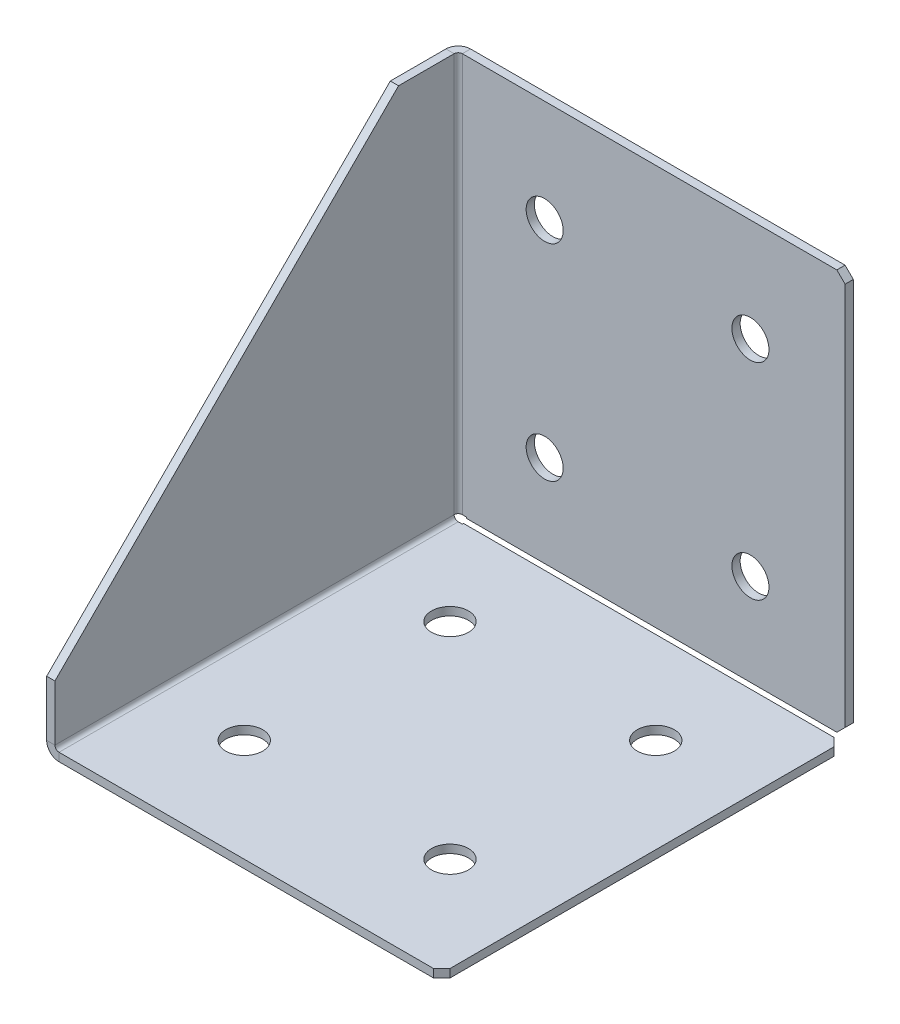
ISO-10303-21;
HEADER;
FILE_DESCRIPTION(('STEP AP214'),'2;1');
FILE_NAME('part.step','',(''),(''),'','','');
FILE_SCHEMA(('AUTOMOTIVE_DESIGN { 1 0 10303 214 1 1 1 1 }'));
ENDSEC;
DATA;
#1=APPLICATION_CONTEXT('core data for automotive mechanical design processes');
#2=APPLICATION_PROTOCOL_DEFINITION('international standard','automotive_design',2000,#1);
#3=PRODUCT_CONTEXT('',#1,'mechanical');
#4=PRODUCT('Part','Part','',(#3));
#5=PRODUCT_RELATED_PRODUCT_CATEGORY('part','',(#4));
#6=PRODUCT_DEFINITION_FORMATION('','',#4);
#7=PRODUCT_DEFINITION_CONTEXT('part definition',#1,'design');
#8=PRODUCT_DEFINITION('design','',#6,#7);
#9=PRODUCT_DEFINITION_SHAPE('','',#8);
#10=(LENGTH_UNIT() NAMED_UNIT(*) SI_UNIT(.MILLI.,.METRE.));
#11=(NAMED_UNIT(*) PLANE_ANGLE_UNIT() SI_UNIT($,.RADIAN.));
#12=(NAMED_UNIT(*) SI_UNIT($,.STERADIAN.) SOLID_ANGLE_UNIT());
#13=UNCERTAINTY_MEASURE_WITH_UNIT(LENGTH_MEASURE(1.E-05),#10,'distance_accuracy_value','');
#14=(GEOMETRIC_REPRESENTATION_CONTEXT(3) GLOBAL_UNCERTAINTY_ASSIGNED_CONTEXT((#13)) GLOBAL_UNIT_ASSIGNED_CONTEXT((#10,
#11,#12)) REPRESENTATION_CONTEXT('',''));
#15=CARTESIAN_POINT('',(0.,0.,0.));
#16=DIRECTION('',(0.,0.,1.));
#17=DIRECTION('',(1.,0.,0.));
#18=AXIS2_PLACEMENT_3D('',#15,#16,#17);
#19=CARTESIAN_POINT('',(-48.,2.,100.));
#20=DIRECTION('',(0.,-1.,0.));
#21=DIRECTION('',(0.,0.,-1.));
#22=AXIS2_PLACEMENT_3D('',#19,#20,#21);
#23=PLANE('',#22);
#24=CARTESIAN_POINT('',(25.,2.,75.));
#25=DIRECTION('',(0.,1.,0.));
#26=DIRECTION('',(0.,0.,1.));
#27=AXIS2_PLACEMENT_3D('',#24,#25,#26);
#28=CIRCLE('',#27,4.5);
#29=CARTESIAN_POINT('',(25.,2.,79.5));
#30=VERTEX_POINT('',#29);
#31=EDGE_CURVE('E541',#30,#30,#28,.T.);
#32=ORIENTED_EDGE('',*,*,#31,.F.);
#33=EDGE_LOOP('',(#32));
#34=FACE_BOUND('',#33,.T.);
#35=CARTESIAN_POINT('',(-25.,2.,75.));
#36=DIRECTION('',(0.,1.,0.));
#37=DIRECTION('',(0.,0.,1.));
#38=AXIS2_PLACEMENT_3D('',#35,#36,#37);
#39=CIRCLE('',#38,4.5);
#40=CARTESIAN_POINT('',(-25.,2.,79.5));
#41=VERTEX_POINT('',#40);
#42=EDGE_CURVE('E533',#41,#41,#39,.T.);
#43=ORIENTED_EDGE('',*,*,#42,.F.);
#44=EDGE_LOOP('',(#43));
#45=FACE_BOUND('',#44,.T.);
#46=DIRECTION('',(1.,0.,0.));
#47=VECTOR('',#46,1.);
#48=CARTESIAN_POINT('',(-48.,2.,100.));
#49=LINE('',#48,#47);
#50=CARTESIAN_POINT('',(-45.,2.,100.));
#51=VERTEX_POINT('',#50);
#52=CARTESIAN_POINT('',(46.,2.,100.));
#53=VERTEX_POINT('',#52);
#54=EDGE_CURVE('E351',#51,#53,#49,.T.);
#55=ORIENTED_EDGE('',*,*,#54,.T.);
#56=DIRECTION('',(-0.707106781186552,0.,0.707106781186543));
#57=VECTOR('',#56,1.);
#58=CARTESIAN_POINT('',(48.,2.,98.));
#59=LINE('',#58,#57);
#60=CARTESIAN_POINT('',(48.,2.,98.));
#61=VERTEX_POINT('',#60);
#62=EDGE_CURVE('E432',#53,#61,#59,.F.);
#63=ORIENTED_EDGE('',*,*,#62,.T.);
#64=DIRECTION('',(0.,0.,-1.));
#65=VECTOR('',#64,1.);
#66=CARTESIAN_POINT('',(48.,2.,100.));
#67=LINE('',#66,#65);
#68=CARTESIAN_POINT('',(48.,2.,4.70710678118656));
#69=VERTEX_POINT('',#68);
#70=EDGE_CURVE('E359',#61,#69,#67,.T.);
#71=ORIENTED_EDGE('',*,*,#70,.T.);
#72=DIRECTION('',(-0.707106781186548,0.,-0.707106781186548));
#73=VECTOR('',#72,1.);
#74=CARTESIAN_POINT('',(46.,2.,2.70710678118655));
#75=LINE('',#74,#73);
#76=CARTESIAN_POINT('',(46.,2.,2.70710678118655));
#77=VERTEX_POINT('',#76);
#78=EDGE_CURVE('E429',#69,#77,#75,.T.);
#79=ORIENTED_EDGE('',*,*,#78,.T.);
#80=DIRECTION('',(1.,0.,0.));
#81=VECTOR('',#80,1.);
#82=CARTESIAN_POINT('',(-48.,2.,2.70710678118655));
#83=LINE('',#82,#81);
#84=CARTESIAN_POINT('',(-43.989699,2.,2.70710678118655));
#85=VERTEX_POINT('',#84);
#86=EDGE_CURVE('E329',#85,#77,#83,.T.);
#87=ORIENTED_EDGE('',*,*,#86,.F.);
#88=DIRECTION('',(0.,0.,-1.));
#89=VECTOR('',#88,1.);
#90=CARTESIAN_POINT('',(-43.989699,2.,100.));
#91=LINE('',#90,#89);
#92=CARTESIAN_POINT('',(-43.989699,2.,2.99999999999998));
#93=VERTEX_POINT('',#92);
#94=EDGE_CURVE('E328',#93,#85,#91,.T.);
#95=ORIENTED_EDGE('',*,*,#94,.F.);
#96=DIRECTION('',(1.,0.,0.));
#97=VECTOR('',#96,1.);
#98=CARTESIAN_POINT('',(-48.,2.,2.99999999999998));
#99=LINE('',#98,#97);
#100=CARTESIAN_POINT('',(-45.,2.,2.99999999999998));
#101=VERTEX_POINT('',#100);
#102=EDGE_CURVE('E324',#93,#101,#99,.F.);
#103=ORIENTED_EDGE('',*,*,#102,.T.);
#104=DIRECTION('',(0.,0.,-1.));
#105=VECTOR('',#104,1.);
#106=CARTESIAN_POINT('',(-45.,2.,100.));
#107=LINE('',#106,#105);
#108=EDGE_CURVE('E310',#51,#101,#107,.T.);
#109=ORIENTED_EDGE('',*,*,#108,.F.);
#110=EDGE_LOOP('',(#55,#63,#71,#79,#87,#95,#103,#109));
#111=FACE_BOUND('',#110,.T.);
#112=CARTESIAN_POINT('',(25.,2.,25.));
#113=DIRECTION('',(0.,1.,0.));
#114=DIRECTION('',(0.,0.,1.));
#115=AXIS2_PLACEMENT_3D('',#112,#113,#114);
#116=CIRCLE('',#115,4.5);
#117=CARTESIAN_POINT('',(25.,2.,29.5));
#118=VERTEX_POINT('',#117);
#119=EDGE_CURVE('E525',#118,#118,#116,.T.);
#120=ORIENTED_EDGE('',*,*,#119,.F.);
#121=EDGE_LOOP('',(#120));
#122=FACE_BOUND('',#121,.T.);
#123=CARTESIAN_POINT('',(-25.,2.,25.));
#124=DIRECTION('',(0.,1.,0.));
#125=DIRECTION('',(0.,0.,1.));
#126=AXIS2_PLACEMENT_3D('',#123,#124,#125);
#127=CIRCLE('',#126,4.5);
#128=CARTESIAN_POINT('',(-25.,2.,29.5));
#129=VERTEX_POINT('',#128);
#130=EDGE_CURVE('E549',#129,#129,#127,.T.);
#131=ORIENTED_EDGE('',*,*,#130,.F.);
#132=EDGE_LOOP('',(#131));
#133=FACE_BOUND('',#132,.T.);
#134=ADVANCED_FACE('F53',(#34,#45,#111,#122,#133),#23,.F.);
#135=CARTESIAN_POINT('',(-48.,0.,2.));
#136=DIRECTION('',(0.,0.,-1.));
#137=DIRECTION('',(-1.,0.,0.));
#138=AXIS2_PLACEMENT_3D('',#135,#136,#137);
#139=PLANE('',#138);
#140=CARTESIAN_POINT('',(25.,75.,2.));
#141=DIRECTION('',(0.,0.,1.));
#142=DIRECTION('',(1.,0.,0.));
#143=AXIS2_PLACEMENT_3D('',#140,#141,#142);
#144=CIRCLE('',#143,4.5);
#145=CARTESIAN_POINT('',(29.5,75.,2.));
#146=VERTEX_POINT('',#145);
#147=EDGE_CURVE('E509',#146,#146,#144,.T.);
#148=ORIENTED_EDGE('',*,*,#147,.F.);
#149=EDGE_LOOP('',(#148));
#150=FACE_BOUND('',#149,.T.);
#151=CARTESIAN_POINT('',(-25.,75.,2.));
#152=DIRECTION('',(0.,0.,1.));
#153=DIRECTION('',(1.,0.,0.));
#154=AXIS2_PLACEMENT_3D('',#151,#152,#153);
#155=CIRCLE('',#154,4.5);
#156=CARTESIAN_POINT('',(-20.5,75.,2.));
#157=VERTEX_POINT('',#156);
#158=EDGE_CURVE('E501',#157,#157,#155,.T.);
#159=ORIENTED_EDGE('',*,*,#158,.F.);
#160=EDGE_LOOP('',(#159));
#161=FACE_BOUND('',#160,.T.);
#162=CARTESIAN_POINT('',(25.,25.,2.));
#163=DIRECTION('',(0.,0.,1.));
#164=DIRECTION('',(1.,0.,0.));
#165=AXIS2_PLACEMENT_3D('',#162,#163,#164);
#166=CIRCLE('',#165,4.5);
#167=CARTESIAN_POINT('',(29.5,25.,2.));
#168=VERTEX_POINT('',#167);
#169=EDGE_CURVE('E493',#168,#168,#166,.T.);
#170=ORIENTED_EDGE('',*,*,#169,.F.);
#171=EDGE_LOOP('',(#170));
#172=FACE_BOUND('',#171,.T.);
#173=DIRECTION('',(-1.,0.,0.));
#174=VECTOR('',#173,1.);
#175=CARTESIAN_POINT('',(-48.,2.70710678118655,2.));
#176=LINE('',#175,#174);
#177=CARTESIAN_POINT('',(46.,2.70710678118655,2.));
#178=VERTEX_POINT('',#177);
#179=CARTESIAN_POINT('',(-43.989699,2.70710678118655,2.));
#180=VERTEX_POINT('',#179);
#181=EDGE_CURVE('E325',#178,#180,#176,.T.);
#182=ORIENTED_EDGE('',*,*,#181,.F.);
#183=DIRECTION('',(0.70710678118655,0.707106781186545,0.));
#184=VECTOR('',#183,1.);
#185=CARTESIAN_POINT('',(48.,4.70710678118658,2.));
#186=LINE('',#185,#184);
#187=CARTESIAN_POINT('',(48.,4.70710678118658,2.));
#188=VERTEX_POINT('',#187);
#189=EDGE_CURVE('E452',#178,#188,#186,.T.);
#190=ORIENTED_EDGE('',*,*,#189,.T.);
#191=DIRECTION('',(0.,1.,0.));
#192=VECTOR('',#191,1.);
#193=CARTESIAN_POINT('',(48.,0.,2.));
#194=LINE('',#193,#192);
#195=CARTESIAN_POINT('',(48.,98.,2.));
#196=VERTEX_POINT('',#195);
#197=EDGE_CURVE('E330',#188,#196,#194,.T.);
#198=ORIENTED_EDGE('',*,*,#197,.T.);
#199=DIRECTION('',(-0.707106781186548,0.707106781186548,0.));
#200=VECTOR('',#199,1.);
#201=CARTESIAN_POINT('',(46.,100.,2.));
#202=LINE('',#201,#200);
#203=CARTESIAN_POINT('',(46.,100.,2.));
#204=VERTEX_POINT('',#203);
#205=EDGE_CURVE('E70',#196,#204,#202,.T.);
#206=ORIENTED_EDGE('',*,*,#205,.T.);
#207=DIRECTION('',(-1.,0.,0.));
#208=VECTOR('',#207,1.);
#209=CARTESIAN_POINT('',(-48.,100.,2.));
#210=LINE('',#209,#208);
#211=CARTESIAN_POINT('',(-45.,100.,2.));
#212=VERTEX_POINT('',#211);
#213=EDGE_CURVE('E333',#212,#204,#210,.F.);
#214=ORIENTED_EDGE('',*,*,#213,.F.);
#215=DIRECTION('',(0.,1.,0.));
#216=VECTOR('',#215,1.);
#217=CARTESIAN_POINT('',(-45.,0.,2.));
#218=LINE('',#217,#216);
#219=CARTESIAN_POINT('',(-45.,2.99999999999998,2.));
#220=VERTEX_POINT('',#219);
#221=EDGE_CURVE('E301',#220,#212,#218,.T.);
#222=ORIENTED_EDGE('',*,*,#221,.F.);
#223=DIRECTION('',(-1.,0.,0.));
#224=VECTOR('',#223,1.);
#225=CARTESIAN_POINT('',(-48.,2.99999999999998,2.));
#226=LINE('',#225,#224);
#227=CARTESIAN_POINT('',(-43.989699,2.99999999999998,2.));
#228=VERTEX_POINT('',#227);
#229=EDGE_CURVE('E306',#220,#228,#226,.F.);
#230=ORIENTED_EDGE('',*,*,#229,.T.);
#231=DIRECTION('',(0.,1.,0.));
#232=VECTOR('',#231,1.);
#233=CARTESIAN_POINT('',(-43.989699,0.,2.));
#234=LINE('',#233,#232);
#235=EDGE_CURVE('E320',#180,#228,#234,.T.);
#236=ORIENTED_EDGE('',*,*,#235,.F.);
#237=EDGE_LOOP('',(#182,#190,#198,#206,#214,#222,#230,#236));
#238=FACE_BOUND('',#237,.T.);
#239=CARTESIAN_POINT('',(-25.,25.,2.));
#240=DIRECTION('',(0.,0.,1.));
#241=DIRECTION('',(1.,0.,0.));
#242=AXIS2_PLACEMENT_3D('',#239,#240,#241);
#243=CIRCLE('',#242,4.5);
#244=CARTESIAN_POINT('',(-20.5,25.,2.));
#245=VERTEX_POINT('',#244);
#246=EDGE_CURVE('E517',#245,#245,#243,.T.);
#247=ORIENTED_EDGE('',*,*,#246,.F.);
#248=EDGE_LOOP('',(#247));
#249=FACE_BOUND('',#248,.T.);
#250=ADVANCED_FACE('F560',(#150,#161,#172,#238,#249),#139,.F.);
#251=CARTESIAN_POINT('',(-45.,3.,2.99999999999998));
#252=DIRECTION('',(0.,0.,-1.));
#253=DIRECTION('',(-1.,0.,0.));
#254=AXIS2_PLACEMENT_3D('',#251,#252,#253);
#255=PLANE('',#254);
#256=DIRECTION('',(-1.,0.,0.));
#257=VECTOR('',#256,1.);
#258=CARTESIAN_POINT('',(-48.,2.99999999999998,2.99999999999998));
#259=LINE('',#258,#257);
#260=CARTESIAN_POINT('',(-46.,2.99999999999998,2.99999999999999));
#261=VERTEX_POINT('',#260);
#262=CARTESIAN_POINT('',(-48.,2.99999999999998,2.99999999999998));
#263=VERTEX_POINT('',#262);
#264=EDGE_CURVE('E408',#261,#263,#259,.T.);
#265=ORIENTED_EDGE('',*,*,#264,.F.);
#266=CARTESIAN_POINT('',(-45.,3.,2.99999999999998));
#267=DIRECTION('',(0.,0.,1.));
#268=DIRECTION('',(1.,0.,0.));
#269=AXIS2_PLACEMENT_3D('',#266,#267,#268);
#270=CIRCLE('',#269,1.);
#271=EDGE_CURVE('E355',#261,#101,#270,.T.);
#272=ORIENTED_EDGE('',*,*,#271,.T.);
#273=DIRECTION('',(0.,-1.,0.));
#274=VECTOR('',#273,1.);
#275=CARTESIAN_POINT('',(-45.,0.,2.99999999999998));
#276=LINE('',#275,#274);
#277=CARTESIAN_POINT('',(-45.,0.,2.99999999999998));
#278=VERTEX_POINT('',#277);
#279=EDGE_CURVE('E405',#101,#278,#276,.T.);
#280=ORIENTED_EDGE('',*,*,#279,.T.);
#281=CARTESIAN_POINT('',(-45.,3.,2.99999999999998));
#282=DIRECTION('',(0.,0.,1.));
#283=DIRECTION('',(1.,0.,0.));
#284=AXIS2_PLACEMENT_3D('',#281,#282,#283);
#285=CIRCLE('',#284,3.);
#286=EDGE_CURVE('E293',#263,#278,#285,.T.);
#287=ORIENTED_EDGE('',*,*,#286,.F.);
#288=EDGE_LOOP('',(#265,#272,#280,#287));
#289=FACE_BOUND('',#288,.T.);
#290=ADVANCED_FACE('F566',(#289),#255,.T.);
#291=CARTESIAN_POINT('',(-48.,0.,2.99999999999998));
#292=DIRECTION('',(0.,0.,1.));
#293=DIRECTION('',(-1.,0.,0.));
#294=AXIS2_PLACEMENT_3D('',#291,#292,#293);
#295=PLANE('',#294);
#296=ORIENTED_EDGE('',*,*,#279,.F.);
#297=ORIENTED_EDGE('',*,*,#102,.F.);
#298=DIRECTION('',(0.,-1.,0.));
#299=VECTOR('',#298,1.);
#300=CARTESIAN_POINT('',(-43.989699,0.,2.99999999999998));
#301=LINE('',#300,#299);
#302=CARTESIAN_POINT('',(-43.989699,0.,2.99999999999998));
#303=VERTEX_POINT('',#302);
#304=EDGE_CURVE('E402',#93,#303,#301,.T.);
#305=ORIENTED_EDGE('',*,*,#304,.T.);
#306=DIRECTION('',(-1.,0.,0.));
#307=VECTOR('',#306,1.);
#308=CARTESIAN_POINT('',(-48.,0.,2.99999999999998));
#309=LINE('',#308,#307);
#310=EDGE_CURVE('E257',#303,#278,#309,.T.);
#311=ORIENTED_EDGE('',*,*,#310,.T.);
#312=EDGE_LOOP('',(#296,#297,#305,#311));
#313=FACE_BOUND('',#312,.T.);
#314=ADVANCED_FACE('F629',(#313),#295,.F.);
#315=CARTESIAN_POINT('',(-43.989699,0.,100.));
#316=DIRECTION('',(-1.,0.,0.));
#317=DIRECTION('',(0.,0.,-1.));
#318=AXIS2_PLACEMENT_3D('',#315,#316,#317);
#319=PLANE('',#318);
#320=ORIENTED_EDGE('',*,*,#304,.F.);
#321=ORIENTED_EDGE('',*,*,#94,.T.);
#322=DIRECTION('',(0.,-1.,0.));
#323=VECTOR('',#322,1.);
#324=CARTESIAN_POINT('',(-43.989699,0.,2.70710678118655));
#325=LINE('',#324,#323);
#326=CARTESIAN_POINT('',(-43.989699,0.,2.70710678118655));
#327=VERTEX_POINT('',#326);
#328=EDGE_CURVE('E399',#85,#327,#325,.T.);
#329=ORIENTED_EDGE('',*,*,#328,.T.);
#330=DIRECTION('',(0.,0.,-1.));
#331=VECTOR('',#330,1.);
#332=CARTESIAN_POINT('',(-43.989699,0.,100.));
#333=LINE('',#332,#331);
#334=EDGE_CURVE('E253',#303,#327,#333,.T.);
#335=ORIENTED_EDGE('',*,*,#334,.F.);
#336=EDGE_LOOP('',(#320,#321,#329,#335));
#337=FACE_BOUND('',#336,.T.);
#338=ADVANCED_FACE('F472',(#337),#319,.T.);
#339=CARTESIAN_POINT('',(-48.,0.,2.70710678118655));
#340=DIRECTION('',(0.,0.,-1.));
#341=DIRECTION('',(1.,0.,0.));
#342=AXIS2_PLACEMENT_3D('',#339,#340,#341);
#343=PLANE('',#342);
#344=ORIENTED_EDGE('',*,*,#86,.T.);
#345=DIRECTION('',(0.,-1.,0.));
#346=VECTOR('',#345,1.);
#347=CARTESIAN_POINT('',(46.,0.,2.70710678118655));
#348=LINE('',#347,#346);
#349=CARTESIAN_POINT('',(46.,0.,2.70710678118655));
#350=VERTEX_POINT('',#349);
#351=EDGE_CURVE('E63',#77,#350,#348,.T.);
#352=ORIENTED_EDGE('',*,*,#351,.T.);
#353=DIRECTION('',(1.,0.,0.));
#354=VECTOR('',#353,1.);
#355=CARTESIAN_POINT('',(-48.,0.,2.70710678118655));
#356=LINE('',#355,#354);
#357=EDGE_CURVE('E246',#327,#350,#356,.T.);
#358=ORIENTED_EDGE('',*,*,#357,.F.);
#359=ORIENTED_EDGE('',*,*,#328,.F.);
#360=EDGE_LOOP('',(#344,#352,#358,#359));
#361=FACE_BOUND('',#360,.T.);
#362=ADVANCED_FACE('F461',(#361),#343,.T.);
#363=CARTESIAN_POINT('',(48.,0.,100.));
#364=DIRECTION('',(-1.,0.,0.));
#365=DIRECTION('',(0.,0.,-1.));
#366=AXIS2_PLACEMENT_3D('',#363,#364,#365);
#367=PLANE('',#366);
#368=ORIENTED_EDGE('',*,*,#70,.F.);
#369=DIRECTION('',(0.,1.,0.));
#370=VECTOR('',#369,1.);
#371=CARTESIAN_POINT('',(48.,0.,98.));
#372=LINE('',#371,#370);
#373=CARTESIAN_POINT('',(48.,0.,98.));
#374=VERTEX_POINT('',#373);
#375=EDGE_CURVE('E416',#61,#374,#372,.F.);
#376=ORIENTED_EDGE('',*,*,#375,.T.);
#377=DIRECTION('',(0.,0.,-1.));
#378=VECTOR('',#377,1.);
#379=CARTESIAN_POINT('',(48.,0.,100.));
#380=LINE('',#379,#378);
#381=CARTESIAN_POINT('',(48.,0.,4.70710678118656));
#382=VERTEX_POINT('',#381);
#383=EDGE_CURVE('E286',#374,#382,#380,.T.);
#384=ORIENTED_EDGE('',*,*,#383,.T.);
#385=DIRECTION('',(0.,-1.,0.));
#386=VECTOR('',#385,1.);
#387=CARTESIAN_POINT('',(48.,0.,4.70710678118656));
#388=LINE('',#387,#386);
#389=EDGE_CURVE('E411',#382,#69,#388,.F.);
#390=ORIENTED_EDGE('',*,*,#389,.T.);
#391=EDGE_LOOP('',(#368,#376,#384,#390));
#392=FACE_BOUND('',#391,.T.);
#393=ADVANCED_FACE('F481',(#392),#367,.F.);
#394=CARTESIAN_POINT('',(-48.,0.,100.));
#395=DIRECTION('',(0.,0.,-1.));
#396=DIRECTION('',(1.,0.,0.));
#397=AXIS2_PLACEMENT_3D('',#394,#395,#396);
#398=PLANE('',#397);
#399=DIRECTION('',(1.,0.,0.));
#400=VECTOR('',#399,1.);
#401=CARTESIAN_POINT('',(-48.,0.,100.));
#402=LINE('',#401,#400);
#403=CARTESIAN_POINT('',(-45.,0.,100.));
#404=VERTEX_POINT('',#403);
#405=CARTESIAN_POINT('',(46.,0.,100.));
#406=VERTEX_POINT('',#405);
#407=EDGE_CURVE('E226',#404,#406,#402,.T.);
#408=ORIENTED_EDGE('',*,*,#407,.T.);
#409=DIRECTION('',(0.,-1.,0.));
#410=VECTOR('',#409,1.);
#411=CARTESIAN_POINT('',(46.,0.,100.));
#412=LINE('',#411,#410);
#413=EDGE_CURVE('E426',#406,#53,#412,.F.);
#414=ORIENTED_EDGE('',*,*,#413,.T.);
#415=ORIENTED_EDGE('',*,*,#54,.F.);
#416=DIRECTION('',(0.,-1.,0.));
#417=VECTOR('',#416,1.);
#418=CARTESIAN_POINT('',(-45.,0.,100.));
#419=LINE('',#418,#417);
#420=EDGE_CURVE('E396',#51,#404,#419,.T.);
#421=ORIENTED_EDGE('',*,*,#420,.T.);
#422=EDGE_LOOP('',(#408,#414,#415,#421));
#423=FACE_BOUND('',#422,.T.);
#424=ADVANCED_FACE('F618',(#423),#398,.F.);
#425=CARTESIAN_POINT('',(-45.,3.,100.));
#426=DIRECTION('',(0.,0.,-1.));
#427=DIRECTION('',(-1.,0.,0.));
#428=AXIS2_PLACEMENT_3D('',#425,#426,#427);
#429=PLANE('',#428);
#430=ORIENTED_EDGE('',*,*,#420,.F.);
#431=CARTESIAN_POINT('',(-45.,3.,100.));
#432=DIRECTION('',(0.,0.,1.));
#433=DIRECTION('',(1.,0.,0.));
#434=AXIS2_PLACEMENT_3D('',#431,#432,#433);
#435=CIRCLE('',#434,1.);
#436=CARTESIAN_POINT('',(-46.,3.,100.));
#437=VERTEX_POINT('',#436);
#438=EDGE_CURVE('E342',#51,#437,#435,.F.);
#439=ORIENTED_EDGE('',*,*,#438,.T.);
#440=DIRECTION('',(-1.,0.,0.));
#441=VECTOR('',#440,1.);
#442=CARTESIAN_POINT('',(-48.,3.,100.));
#443=LINE('',#442,#441);
#444=CARTESIAN_POINT('',(-48.,3.,100.));
#445=VERTEX_POINT('',#444);
#446=EDGE_CURVE('E213',#437,#445,#443,.T.);
#447=ORIENTED_EDGE('',*,*,#446,.T.);
#448=CARTESIAN_POINT('',(-45.,3.,100.));
#449=DIRECTION('',(0.,0.,1.));
#450=DIRECTION('',(1.,0.,0.));
#451=AXIS2_PLACEMENT_3D('',#448,#449,#450);
#452=CIRCLE('',#451,3.);
#453=EDGE_CURVE('E282',#404,#445,#452,.F.);
#454=ORIENTED_EDGE('',*,*,#453,.F.);
#455=EDGE_LOOP('',(#430,#439,#447,#454));
#456=FACE_BOUND('',#455,.T.);
#457=ADVANCED_FACE('F615',(#456),#429,.F.);
#458=CARTESIAN_POINT('',(-48.,16.5,100.));
#459=DIRECTION('',(0.,0.,1.));
#460=DIRECTION('',(0.,-1.,0.));
#461=AXIS2_PLACEMENT_3D('',#458,#459,#460);
#462=PLANE('',#461);
#463=ORIENTED_EDGE('',*,*,#446,.F.);
#464=DIRECTION('',(0.,1.,0.));
#465=VECTOR('',#464,1.);
#466=CARTESIAN_POINT('',(-46.,0.,100.));
#467=LINE('',#466,#465);
#468=CARTESIAN_POINT('',(-46.,16.5,100.));
#469=VERTEX_POINT('',#468);
#470=EDGE_CURVE('E207',#469,#437,#467,.F.);
#471=ORIENTED_EDGE('',*,*,#470,.F.);
#472=DIRECTION('',(-1.,0.,0.));
#473=VECTOR('',#472,1.);
#474=CARTESIAN_POINT('',(-48.,16.5,100.));
#475=LINE('',#474,#473);
#476=CARTESIAN_POINT('',(-48.,16.5,100.));
#477=VERTEX_POINT('',#476);
#478=EDGE_CURVE('E201',#469,#477,#475,.T.);
#479=ORIENTED_EDGE('',*,*,#478,.T.);
#480=DIRECTION('',(0.,-1.,0.));
#481=VECTOR('',#480,1.);
#482=CARTESIAN_POINT('',(-48.,16.5,100.));
#483=LINE('',#482,#481);
#484=EDGE_CURVE('E204',#477,#445,#483,.T.);
#485=ORIENTED_EDGE('',*,*,#484,.T.);
#486=EDGE_LOOP('',(#463,#471,#479,#485));
#487=FACE_BOUND('',#486,.T.);
#488=ADVANCED_FACE('F203',(#487),#462,.T.);
#489=CARTESIAN_POINT('',(-48.,100.,16.5));
#490=DIRECTION('',(0.,0.707106781186548,0.707106781186548));
#491=DIRECTION('',(0.,-0.707106781186547,0.707106781186547));
#492=AXIS2_PLACEMENT_3D('',#489,#490,#491);
#493=PLANE('',#492);
#494=ORIENTED_EDGE('',*,*,#478,.F.);
#495=DIRECTION('',(0.,-0.707106781186547,0.707106781186547));
#496=VECTOR('',#495,1.);
#497=CARTESIAN_POINT('',(-46.,100.,16.5));
#498=LINE('',#497,#496);
#499=CARTESIAN_POINT('',(-46.,100.,16.5));
#500=VERTEX_POINT('',#499);
#501=EDGE_CURVE('E346',#500,#469,#498,.T.);
#502=ORIENTED_EDGE('',*,*,#501,.F.);
#503=DIRECTION('',(-1.,0.,0.));
#504=VECTOR('',#503,1.);
#505=CARTESIAN_POINT('',(-48.,100.,16.5));
#506=LINE('',#505,#504);
#507=CARTESIAN_POINT('',(-48.,100.,16.5));
#508=VERTEX_POINT('',#507);
#509=EDGE_CURVE('E214',#500,#508,#506,.T.);
#510=ORIENTED_EDGE('',*,*,#509,.T.);
#511=DIRECTION('',(0.,-0.707106781186547,0.707106781186547));
#512=VECTOR('',#511,1.);
#513=CARTESIAN_POINT('',(-48.,100.,16.5));
#514=LINE('',#513,#512);
#515=EDGE_CURVE('E221',#508,#477,#514,.T.);
#516=ORIENTED_EDGE('',*,*,#515,.T.);
#517=EDGE_LOOP('',(#494,#502,#510,#516));
#518=FACE_BOUND('',#517,.T.);
#519=ADVANCED_FACE('F228',(#518),#493,.T.);
#520=CARTESIAN_POINT('',(-48.,100.,0.));
#521=DIRECTION('',(0.,1.,0.));
#522=DIRECTION('',(0.,0.,1.));
#523=AXIS2_PLACEMENT_3D('',#520,#521,#522);
#524=PLANE('',#523);
#525=ORIENTED_EDGE('',*,*,#509,.F.);
#526=DIRECTION('',(0.,0.,-1.));
#527=VECTOR('',#526,1.);
#528=CARTESIAN_POINT('',(-46.,100.,0.));
#529=LINE('',#528,#527);
#530=CARTESIAN_POINT('',(-46.,100.,3.));
#531=VERTEX_POINT('',#530);
#532=EDGE_CURVE('E336',#531,#500,#529,.F.);
#533=ORIENTED_EDGE('',*,*,#532,.F.);
#534=DIRECTION('',(-1.,0.,0.));
#535=VECTOR('',#534,1.);
#536=CARTESIAN_POINT('',(-48.,100.,3.));
#537=LINE('',#536,#535);
#538=CARTESIAN_POINT('',(-48.,100.,3.));
#539=VERTEX_POINT('',#538);
#540=EDGE_CURVE('E389',#531,#539,#537,.T.);
#541=ORIENTED_EDGE('',*,*,#540,.T.);
#542=DIRECTION('',(0.,0.,1.));
#543=VECTOR('',#542,1.);
#544=CARTESIAN_POINT('',(-48.,100.,0.));
#545=LINE('',#544,#543);
#546=EDGE_CURVE('E230',#539,#508,#545,.T.);
#547=ORIENTED_EDGE('',*,*,#546,.T.);
#548=EDGE_LOOP('',(#525,#533,#541,#547));
#549=FACE_BOUND('',#548,.T.);
#550=ADVANCED_FACE('F606',(#549),#524,.T.);
#551=CARTESIAN_POINT('',(-45.,100.,3.));
#552=DIRECTION('',(0.,1.,0.));
#553=DIRECTION('',(0.,0.,1.));
#554=AXIS2_PLACEMENT_3D('',#551,#552,#553);
#555=PLANE('',#554);
#556=ORIENTED_EDGE('',*,*,#540,.F.);
#557=CARTESIAN_POINT('',(-45.,100.,3.));
#558=DIRECTION('',(0.,-1.,0.));
#559=DIRECTION('',(0.,0.,-1.));
#560=AXIS2_PLACEMENT_3D('',#557,#558,#559);
#561=CIRCLE('',#560,1.);
#562=EDGE_CURVE('E337',#531,#212,#561,.T.);
#563=ORIENTED_EDGE('',*,*,#562,.T.);
#564=DIRECTION('',(0.,0.,-1.));
#565=VECTOR('',#564,1.);
#566=CARTESIAN_POINT('',(-45.,100.,0.));
#567=LINE('',#566,#565);
#568=CARTESIAN_POINT('',(-45.,100.,0.));
#569=VERTEX_POINT('',#568);
#570=EDGE_CURVE('E386',#212,#569,#567,.T.);
#571=ORIENTED_EDGE('',*,*,#570,.T.);
#572=CARTESIAN_POINT('',(-45.,100.,3.));
#573=DIRECTION('',(0.,-1.,0.));
#574=DIRECTION('',(0.,0.,-1.));
#575=AXIS2_PLACEMENT_3D('',#572,#573,#574);
#576=CIRCLE('',#575,3.);
#577=EDGE_CURVE('E277',#539,#569,#576,.T.);
#578=ORIENTED_EDGE('',*,*,#577,.F.);
#579=EDGE_LOOP('',(#556,#563,#571,#578));
#580=FACE_BOUND('',#579,.T.);
#581=ADVANCED_FACE('F602',(#580),#555,.T.);
#582=CARTESIAN_POINT('',(-48.,100.,0.));
#583=DIRECTION('',(0.,1.,0.));
#584=DIRECTION('',(1.,0.,0.));
#585=AXIS2_PLACEMENT_3D('',#582,#583,#584);
#586=PLANE('',#585);
#587=ORIENTED_EDGE('',*,*,#213,.T.);
#588=DIRECTION('',(0.,0.,-1.));
#589=VECTOR('',#588,1.);
#590=CARTESIAN_POINT('',(46.,100.,0.));
#591=LINE('',#590,#589);
#592=CARTESIAN_POINT('',(46.,100.,0.));
#593=VERTEX_POINT('',#592);
#594=EDGE_CURVE('E11',#204,#593,#591,.T.);
#595=ORIENTED_EDGE('',*,*,#594,.T.);
#596=DIRECTION('',(1.,0.,0.));
#597=VECTOR('',#596,1.);
#598=CARTESIAN_POINT('',(-48.,100.,0.));
#599=LINE('',#598,#597);
#600=EDGE_CURVE('E235',#569,#593,#599,.T.);
#601=ORIENTED_EDGE('',*,*,#600,.F.);
#602=ORIENTED_EDGE('',*,*,#570,.F.);
#603=EDGE_LOOP('',(#587,#595,#601,#602));
#604=FACE_BOUND('',#603,.T.);
#605=ADVANCED_FACE('F598',(#604),#586,.T.);
#606=CARTESIAN_POINT('',(48.,0.,0.));
#607=DIRECTION('',(-1.,0.,0.));
#608=DIRECTION('',(0.,1.,0.));
#609=AXIS2_PLACEMENT_3D('',#606,#607,#608);
#610=PLANE('',#609);
#611=ORIENTED_EDGE('',*,*,#197,.F.);
#612=DIRECTION('',(0.,0.,1.));
#613=VECTOR('',#612,1.);
#614=CARTESIAN_POINT('',(48.,4.70710678118658,0.));
#615=LINE('',#614,#613);
#616=CARTESIAN_POINT('',(48.,4.70710678118658,0.));
#617=VERTEX_POINT('',#616);
#618=EDGE_CURVE('E438',#188,#617,#615,.F.);
#619=ORIENTED_EDGE('',*,*,#618,.T.);
#620=DIRECTION('',(0.,1.,0.));
#621=VECTOR('',#620,1.);
#622=CARTESIAN_POINT('',(48.,0.,0.));
#623=LINE('',#622,#621);
#624=CARTESIAN_POINT('',(48.,98.,0.));
#625=VERTEX_POINT('',#624);
#626=EDGE_CURVE('E242',#617,#625,#623,.T.);
#627=ORIENTED_EDGE('',*,*,#626,.T.);
#628=DIRECTION('',(0.,0.,-1.));
#629=VECTOR('',#628,1.);
#630=CARTESIAN_POINT('',(48.,98.,0.));
#631=LINE('',#630,#629);
#632=EDGE_CURVE('E435',#625,#196,#631,.F.);
#633=ORIENTED_EDGE('',*,*,#632,.T.);
#634=EDGE_LOOP('',(#611,#619,#627,#633));
#635=FACE_BOUND('',#634,.T.);
#636=ADVANCED_FACE('F595',(#635),#610,.F.);
#637=CARTESIAN_POINT('',(-48.,2.70710678118655,0.));
#638=DIRECTION('',(0.,-1.,0.));
#639=DIRECTION('',(-1.,0.,0.));
#640=AXIS2_PLACEMENT_3D('',#637,#638,#639);
#641=PLANE('',#640);
#642=DIRECTION('',(-1.,0.,0.));
#643=VECTOR('',#642,1.);
#644=CARTESIAN_POINT('',(-48.,2.70710678118655,0.));
#645=LINE('',#644,#643);
#646=CARTESIAN_POINT('',(46.,2.70710678118655,0.));
#647=VERTEX_POINT('',#646);
#648=CARTESIAN_POINT('',(-43.989699,2.70710678118655,0.));
#649=VERTEX_POINT('',#648);
#650=EDGE_CURVE('E250',#647,#649,#645,.T.);
#651=ORIENTED_EDGE('',*,*,#650,.F.);
#652=DIRECTION('',(0.,0.,1.));
#653=VECTOR('',#652,1.);
#654=CARTESIAN_POINT('',(46.,2.70710678118655,0.));
#655=LINE('',#654,#653);
#656=EDGE_CURVE('E78',#647,#178,#655,.T.);
#657=ORIENTED_EDGE('',*,*,#656,.T.);
#658=ORIENTED_EDGE('',*,*,#181,.T.);
#659=DIRECTION('',(0.,0.,-1.));
#660=VECTOR('',#659,1.);
#661=CARTESIAN_POINT('',(-43.989699,2.70710678118655,0.));
#662=LINE('',#661,#660);
#663=EDGE_CURVE('E382',#180,#649,#662,.T.);
#664=ORIENTED_EDGE('',*,*,#663,.T.);
#665=EDGE_LOOP('',(#651,#657,#658,#664));
#666=FACE_BOUND('',#665,.T.);
#667=ADVANCED_FACE('F591',(#666),#641,.T.);
#668=CARTESIAN_POINT('',(-43.989699,0.,0.));
#669=DIRECTION('',(-1.,0.,0.));
#670=DIRECTION('',(0.,1.,0.));
#671=AXIS2_PLACEMENT_3D('',#668,#669,#670);
#672=PLANE('',#671);
#673=ORIENTED_EDGE('',*,*,#663,.F.);
#674=ORIENTED_EDGE('',*,*,#235,.T.);
#675=DIRECTION('',(0.,0.,-1.));
#676=VECTOR('',#675,1.);
#677=CARTESIAN_POINT('',(-43.989699,2.99999999999998,0.));
#678=LINE('',#677,#676);
#679=CARTESIAN_POINT('',(-43.989699,2.99999999999998,0.));
#680=VERTEX_POINT('',#679);
#681=EDGE_CURVE('E379',#228,#680,#678,.T.);
#682=ORIENTED_EDGE('',*,*,#681,.T.);
#683=DIRECTION('',(0.,1.,0.));
#684=VECTOR('',#683,1.);
#685=CARTESIAN_POINT('',(-43.989699,0.,0.));
#686=LINE('',#685,#684);
#687=EDGE_CURVE('E261',#649,#680,#686,.T.);
#688=ORIENTED_EDGE('',*,*,#687,.F.);
#689=EDGE_LOOP('',(#673,#674,#682,#688));
#690=FACE_BOUND('',#689,.T.);
#691=ADVANCED_FACE('F587',(#690),#672,.T.);
#692=CARTESIAN_POINT('',(-48.,2.99999999999998,0.));
#693=DIRECTION('',(0.,1.,0.));
#694=DIRECTION('',(1.,0.,0.));
#695=AXIS2_PLACEMENT_3D('',#692,#693,#694);
#696=PLANE('',#695);
#697=ORIENTED_EDGE('',*,*,#681,.F.);
#698=ORIENTED_EDGE('',*,*,#229,.F.);
#699=DIRECTION('',(0.,0.,-1.));
#700=VECTOR('',#699,1.);
#701=CARTESIAN_POINT('',(-45.,2.99999999999998,0.));
#702=LINE('',#701,#700);
#703=CARTESIAN_POINT('',(-45.,2.99999999999998,0.));
#704=VERTEX_POINT('',#703);
#705=EDGE_CURVE('E292',#220,#704,#702,.T.);
#706=ORIENTED_EDGE('',*,*,#705,.T.);
#707=DIRECTION('',(1.,0.,0.));
#708=VECTOR('',#707,1.);
#709=CARTESIAN_POINT('',(-48.,2.99999999999998,0.));
#710=LINE('',#709,#708);
#711=EDGE_CURVE('E265',#704,#680,#710,.T.);
#712=ORIENTED_EDGE('',*,*,#711,.T.);
#713=EDGE_LOOP('',(#697,#698,#706,#712));
#714=FACE_BOUND('',#713,.T.);
#715=ADVANCED_FACE('F583',(#714),#696,.F.);
#716=CARTESIAN_POINT('',(-45.,2.99999999999998,3.));
#717=DIRECTION('',(0.,-1.,0.));
#718=DIRECTION('',(0.,0.,-1.));
#719=AXIS2_PLACEMENT_3D('',#716,#717,#718);
#720=PLANE('',#719);
#721=CARTESIAN_POINT('',(-45.,2.99999999999998,3.));
#722=DIRECTION('',(0.,-1.,0.));
#723=DIRECTION('',(0.,0.,-1.));
#724=AXIS2_PLACEMENT_3D('',#721,#722,#723);
#725=CIRCLE('',#724,1.);
#726=EDGE_CURVE('E341',#220,#261,#725,.F.);
#727=ORIENTED_EDGE('',*,*,#726,.T.);
#728=ORIENTED_EDGE('',*,*,#264,.T.);
#729=CARTESIAN_POINT('',(-45.,2.99999999999998,3.));
#730=DIRECTION('',(0.,1.,0.));
#731=DIRECTION('',(0.,0.,1.));
#732=AXIS2_PLACEMENT_3D('',#729,#730,#731);
#733=CIRCLE('',#732,3.);
#734=EDGE_CURVE('E281',#704,#263,#733,.T.);
#735=ORIENTED_EDGE('',*,*,#734,.F.);
#736=ORIENTED_EDGE('',*,*,#705,.F.);
#737=EDGE_LOOP('',(#727,#728,#735,#736));
#738=FACE_BOUND('',#737,.T.);
#739=ADVANCED_FACE('F586',(#738),#720,.T.);
#740=CARTESIAN_POINT('',(-48.,0.,0.));
#741=DIRECTION('',(0.,0.,-1.));
#742=DIRECTION('',(-1.,0.,0.));
#743=AXIS2_PLACEMENT_3D('',#740,#741,#742);
#744=PLANE('',#743);
#745=CARTESIAN_POINT('',(-25.,25.,0.));
#746=DIRECTION('',(0.,0.,-1.));
#747=DIRECTION('',(-1.,0.,0.));
#748=AXIS2_PLACEMENT_3D('',#745,#746,#747);
#749=CIRCLE('',#748,4.5);
#750=CARTESIAN_POINT('',(-29.5,25.,0.));
#751=VERTEX_POINT('',#750);
#752=EDGE_CURVE('E513',#751,#751,#749,.T.);
#753=ORIENTED_EDGE('',*,*,#752,.F.);
#754=EDGE_LOOP('',(#753));
#755=FACE_BOUND('',#754,.T.);
#756=CARTESIAN_POINT('',(25.,75.,0.));
#757=DIRECTION('',(0.,0.,-1.));
#758=DIRECTION('',(-1.,0.,0.));
#759=AXIS2_PLACEMENT_3D('',#756,#757,#758);
#760=CIRCLE('',#759,4.5);
#761=CARTESIAN_POINT('',(20.5,75.,0.));
#762=VERTEX_POINT('',#761);
#763=EDGE_CURVE('E505',#762,#762,#760,.T.);
#764=ORIENTED_EDGE('',*,*,#763,.F.);
#765=EDGE_LOOP('',(#764));
#766=FACE_BOUND('',#765,.T.);
#767=CARTESIAN_POINT('',(-25.,75.,0.));
#768=DIRECTION('',(0.,0.,-1.));
#769=DIRECTION('',(-1.,0.,0.));
#770=AXIS2_PLACEMENT_3D('',#767,#768,#769);
#771=CIRCLE('',#770,4.5);
#772=CARTESIAN_POINT('',(-29.5,75.,0.));
#773=VERTEX_POINT('',#772);
#774=EDGE_CURVE('E497',#773,#773,#771,.T.);
#775=ORIENTED_EDGE('',*,*,#774,.F.);
#776=EDGE_LOOP('',(#775));
#777=FACE_BOUND('',#776,.T.);
#778=CARTESIAN_POINT('',(25.,25.,0.));
#779=DIRECTION('',(0.,0.,-1.));
#780=DIRECTION('',(-1.,0.,0.));
#781=AXIS2_PLACEMENT_3D('',#778,#779,#780);
#782=CIRCLE('',#781,4.5);
#783=CARTESIAN_POINT('',(20.5,25.,0.));
#784=VERTEX_POINT('',#783);
#785=EDGE_CURVE('E375',#784,#784,#782,.T.);
#786=ORIENTED_EDGE('',*,*,#785,.F.);
#787=EDGE_LOOP('',(#786));
#788=FACE_BOUND('',#787,.T.);
#789=ORIENTED_EDGE('',*,*,#626,.F.);
#790=DIRECTION('',(-0.70710678118655,-0.707106781186545,0.));
#791=VECTOR('',#790,1.);
#792=CARTESIAN_POINT('',(-2.35355339059362,-45.6464466094067,0.));
#793=LINE('',#792,#791);
#794=EDGE_CURVE('E445',#617,#647,#793,.T.);
#795=ORIENTED_EDGE('',*,*,#794,.T.);
#796=ORIENTED_EDGE('',*,*,#650,.T.);
#797=ORIENTED_EDGE('',*,*,#687,.T.);
#798=ORIENTED_EDGE('',*,*,#711,.F.);
#799=DIRECTION('',(0.,1.,0.));
#800=VECTOR('',#799,1.);
#801=CARTESIAN_POINT('',(-45.,100.,0.));
#802=LINE('',#801,#800);
#803=EDGE_CURVE('E269',#704,#569,#802,.T.);
#804=ORIENTED_EDGE('',*,*,#803,.T.);
#805=ORIENTED_EDGE('',*,*,#600,.T.);
#806=DIRECTION('',(0.707106781186548,-0.707106781186548,0.));
#807=VECTOR('',#806,1.);
#808=CARTESIAN_POINT('',(49.,97.,0.));
#809=LINE('',#808,#807);
#810=EDGE_CURVE('E442',#593,#625,#809,.T.);
#811=ORIENTED_EDGE('',*,*,#810,.T.);
#812=EDGE_LOOP('',(#789,#795,#796,#797,#798,#804,#805,#811));
#813=FACE_BOUND('',#812,.T.);
#814=ADVANCED_FACE('F638',(#755,#766,#777,#788,#813),#744,.T.);
#815=CARTESIAN_POINT('',(-48.,0.,0.));
#816=DIRECTION('',(1.,0.,0.));
#817=DIRECTION('',(0.,0.,-1.));
#818=AXIS2_PLACEMENT_3D('',#815,#816,#817);
#819=PLANE('',#818);
#820=DIRECTION('',(0.,1.,0.));
#821=VECTOR('',#820,1.);
#822=CARTESIAN_POINT('',(-48.,2.99999999999998,3.));
#823=LINE('',#822,#821);
#824=EDGE_CURVE('E273',#539,#263,#823,.F.);
#825=ORIENTED_EDGE('',*,*,#824,.T.);
#826=DIRECTION('',(0.,0.,-1.));
#827=VECTOR('',#826,1.);
#828=CARTESIAN_POINT('',(-48.,3.,100.));
#829=LINE('',#828,#827);
#830=EDGE_CURVE('E224',#263,#445,#829,.F.);
#831=ORIENTED_EDGE('',*,*,#830,.T.);
#832=ORIENTED_EDGE('',*,*,#484,.F.);
#833=ORIENTED_EDGE('',*,*,#515,.F.);
#834=ORIENTED_EDGE('',*,*,#546,.F.);
#835=EDGE_LOOP('',(#825,#831,#832,#833,#834));
#836=FACE_BOUND('',#835,.T.);
#837=ADVANCED_FACE('F219',(#836),#819,.F.);
#838=CARTESIAN_POINT('',(-48.,0.,100.));
#839=DIRECTION('',(0.,-1.,0.));
#840=DIRECTION('',(0.,0.,-1.));
#841=AXIS2_PLACEMENT_3D('',#838,#839,#840);
#842=PLANE('',#841);
#843=CARTESIAN_POINT('',(-25.,0.,25.));
#844=DIRECTION('',(0.,-1.,0.));
#845=DIRECTION('',(0.,0.,-1.));
#846=AXIS2_PLACEMENT_3D('',#843,#844,#845);
#847=CIRCLE('',#846,4.5);
#848=CARTESIAN_POINT('',(-25.,0.,20.5));
#849=VERTEX_POINT('',#848);
#850=EDGE_CURVE('E545',#849,#849,#847,.T.);
#851=ORIENTED_EDGE('',*,*,#850,.F.);
#852=EDGE_LOOP('',(#851));
#853=FACE_BOUND('',#852,.T.);
#854=CARTESIAN_POINT('',(25.,0.,75.));
#855=DIRECTION('',(0.,-1.,0.));
#856=DIRECTION('',(0.,0.,-1.));
#857=AXIS2_PLACEMENT_3D('',#854,#855,#856);
#858=CIRCLE('',#857,4.5);
#859=CARTESIAN_POINT('',(25.,0.,70.5));
#860=VERTEX_POINT('',#859);
#861=EDGE_CURVE('E537',#860,#860,#858,.T.);
#862=ORIENTED_EDGE('',*,*,#861,.F.);
#863=EDGE_LOOP('',(#862));
#864=FACE_BOUND('',#863,.T.);
#865=CARTESIAN_POINT('',(-25.,0.,75.));
#866=DIRECTION('',(0.,-1.,0.));
#867=DIRECTION('',(0.,0.,-1.));
#868=AXIS2_PLACEMENT_3D('',#865,#866,#867);
#869=CIRCLE('',#868,4.5);
#870=CARTESIAN_POINT('',(-25.,0.,70.5));
#871=VERTEX_POINT('',#870);
#872=EDGE_CURVE('E529',#871,#871,#869,.T.);
#873=ORIENTED_EDGE('',*,*,#872,.F.);
#874=EDGE_LOOP('',(#873));
#875=FACE_BOUND('',#874,.T.);
#876=CARTESIAN_POINT('',(25.,0.,25.));
#877=DIRECTION('',(0.,-1.,0.));
#878=DIRECTION('',(0.,0.,-1.));
#879=AXIS2_PLACEMENT_3D('',#876,#877,#878);
#880=CIRCLE('',#879,4.5);
#881=CARTESIAN_POINT('',(25.,0.,20.5));
#882=VERTEX_POINT('',#881);
#883=EDGE_CURVE('E521',#882,#882,#880,.T.);
#884=ORIENTED_EDGE('',*,*,#883,.F.);
#885=EDGE_LOOP('',(#884));
#886=FACE_BOUND('',#885,.T.);
#887=ORIENTED_EDGE('',*,*,#383,.F.);
#888=DIRECTION('',(0.707106781186552,0.,-0.707106781186543));
#889=VECTOR('',#888,1.);
#890=CARTESIAN_POINT('',(-1.00000000000067,0.,147.));
#891=LINE('',#890,#889);
#892=EDGE_CURVE('E423',#374,#406,#891,.F.);
#893=ORIENTED_EDGE('',*,*,#892,.T.);
#894=ORIENTED_EDGE('',*,*,#407,.F.);
#895=DIRECTION('',(0.,0.,-1.));
#896=VECTOR('',#895,1.);
#897=CARTESIAN_POINT('',(-45.,0.,2.99999999999998));
#898=LINE('',#897,#896);
#899=EDGE_CURVE('E276',#404,#278,#898,.T.);
#900=ORIENTED_EDGE('',*,*,#899,.T.);
#901=ORIENTED_EDGE('',*,*,#310,.F.);
#902=ORIENTED_EDGE('',*,*,#334,.T.);
#903=ORIENTED_EDGE('',*,*,#357,.T.);
#904=DIRECTION('',(0.707106781186548,0.,0.707106781186548));
#905=VECTOR('',#904,1.);
#906=CARTESIAN_POINT('',(47.6464466094067,0.,4.35355339059328));
#907=LINE('',#906,#905);
#908=EDGE_CURVE('E420',#350,#382,#907,.T.);
#909=ORIENTED_EDGE('',*,*,#908,.T.);
#910=EDGE_LOOP('',(#887,#893,#894,#900,#901,#902,#903,#909));
#911=FACE_BOUND('',#910,.T.);
#912=ADVANCED_FACE('F467',(#853,#864,#875,#886,#911),#842,.T.);
#913=CARTESIAN_POINT('',(-45.,0.,3.));
#914=DIRECTION('',(0.,-1.,0.));
#915=DIRECTION('',(0.,0.,-1.));
#916=AXIS2_PLACEMENT_3D('',#913,#914,#915);
#917=CYLINDRICAL_SURFACE('',#916,3.);
#918=ORIENTED_EDGE('',*,*,#734,.T.);
#919=ORIENTED_EDGE('',*,*,#824,.F.);
#920=ORIENTED_EDGE('',*,*,#577,.T.);
#921=ORIENTED_EDGE('',*,*,#803,.F.);
#922=EDGE_LOOP('',(#918,#919,#920,#921));
#923=FACE_BOUND('',#922,.T.);
#924=ADVANCED_FACE('F671',(#923),#917,.T.);
#925=CARTESIAN_POINT('',(-45.,3.,100.));
#926=DIRECTION('',(0.,0.,1.));
#927=DIRECTION('',(1.,0.,0.));
#928=AXIS2_PLACEMENT_3D('',#925,#926,#927);
#929=CYLINDRICAL_SURFACE('',#928,3.);
#930=ORIENTED_EDGE('',*,*,#453,.T.);
#931=ORIENTED_EDGE('',*,*,#830,.F.);
#932=ORIENTED_EDGE('',*,*,#286,.T.);
#933=ORIENTED_EDGE('',*,*,#899,.F.);
#934=EDGE_LOOP('',(#930,#931,#932,#933));
#935=FACE_BOUND('',#934,.T.);
#936=ADVANCED_FACE('F722',(#935),#929,.T.);
#937=CARTESIAN_POINT('',(-46.,0.,0.));
#938=DIRECTION('',(1.,0.,0.));
#939=DIRECTION('',(0.,0.,-1.));
#940=AXIS2_PLACEMENT_3D('',#937,#938,#939);
#941=PLANE('',#940);
#942=DIRECTION('',(0.,1.,0.));
#943=VECTOR('',#942,1.);
#944=CARTESIAN_POINT('',(-46.,0.,3.));
#945=LINE('',#944,#943);
#946=EDGE_CURVE('E305',#531,#261,#945,.F.);
#947=ORIENTED_EDGE('',*,*,#946,.F.);
#948=ORIENTED_EDGE('',*,*,#532,.T.);
#949=ORIENTED_EDGE('',*,*,#501,.T.);
#950=ORIENTED_EDGE('',*,*,#470,.T.);
#951=DIRECTION('',(0.,0.,-1.));
#952=VECTOR('',#951,1.);
#953=CARTESIAN_POINT('',(-46.,2.99999999999998,0.));
#954=LINE('',#953,#952);
#955=EDGE_CURVE('E297',#261,#437,#954,.F.);
#956=ORIENTED_EDGE('',*,*,#955,.F.);
#957=EDGE_LOOP('',(#947,#948,#949,#950,#956));
#958=FACE_BOUND('',#957,.T.);
#959=ADVANCED_FACE('F573',(#958),#941,.T.);
#960=CARTESIAN_POINT('',(-45.,0.,3.));
#961=DIRECTION('',(0.,-1.,0.));
#962=DIRECTION('',(0.,0.,-1.));
#963=AXIS2_PLACEMENT_3D('',#960,#961,#962);
#964=CYLINDRICAL_SURFACE('',#963,1.);
#965=ORIENTED_EDGE('',*,*,#726,.F.);
#966=ORIENTED_EDGE('',*,*,#221,.T.);
#967=ORIENTED_EDGE('',*,*,#562,.F.);
#968=ORIENTED_EDGE('',*,*,#946,.T.);
#969=EDGE_LOOP('',(#965,#966,#967,#968));
#970=FACE_BOUND('',#969,.T.);
#971=ADVANCED_FACE('F574',(#970),#964,.F.);
#972=CARTESIAN_POINT('',(-45.,3.,100.));
#973=DIRECTION('',(0.,0.,1.));
#974=DIRECTION('',(1.,0.,0.));
#975=AXIS2_PLACEMENT_3D('',#972,#973,#974);
#976=CYLINDRICAL_SURFACE('',#975,1.);
#977=ORIENTED_EDGE('',*,*,#438,.F.);
#978=ORIENTED_EDGE('',*,*,#108,.T.);
#979=ORIENTED_EDGE('',*,*,#271,.F.);
#980=ORIENTED_EDGE('',*,*,#955,.T.);
#981=EDGE_LOOP('',(#977,#978,#979,#980));
#982=FACE_BOUND('',#981,.T.);
#983=ADVANCED_FACE('F577',(#982),#976,.F.);
#984=CARTESIAN_POINT('',(25.,25.,2.));
#985=DIRECTION('',(0.,0.,1.));
#986=DIRECTION('',(1.,0.,0.));
#987=AXIS2_PLACEMENT_3D('',#984,#985,#986);
#988=CYLINDRICAL_SURFACE('',#987,4.5);
#989=ORIENTED_EDGE('',*,*,#169,.T.);
#990=EDGE_LOOP('',(#989));
#991=FACE_BOUND('',#990,.T.);
#992=ORIENTED_EDGE('',*,*,#785,.T.);
#993=EDGE_LOOP('',(#992));
#994=FACE_BOUND('',#993,.T.);
#995=ADVANCED_FACE('F581',(#991,#994),#988,.F.);
#996=CARTESIAN_POINT('',(-25.,75.,2.));
#997=DIRECTION('',(0.,0.,1.));
#998=DIRECTION('',(1.,0.,0.));
#999=AXIS2_PLACEMENT_3D('',#996,#997,#998);
#1000=CYLINDRICAL_SURFACE('',#999,4.5);
#1001=ORIENTED_EDGE('',*,*,#158,.T.);
#1002=EDGE_LOOP('',(#1001));
#1003=FACE_BOUND('',#1002,.T.);
#1004=ORIENTED_EDGE('',*,*,#774,.T.);
#1005=EDGE_LOOP('',(#1004));
#1006=FACE_BOUND('',#1005,.T.);
#1007=ADVANCED_FACE('F705',(#1003,#1006),#1000,.F.);
#1008=CARTESIAN_POINT('',(25.,75.,2.));
#1009=DIRECTION('',(0.,0.,1.));
#1010=DIRECTION('',(1.,0.,0.));
#1011=AXIS2_PLACEMENT_3D('',#1008,#1009,#1010);
#1012=CYLINDRICAL_SURFACE('',#1011,4.5);
#1013=ORIENTED_EDGE('',*,*,#147,.T.);
#1014=EDGE_LOOP('',(#1013));
#1015=FACE_BOUND('',#1014,.T.);
#1016=ORIENTED_EDGE('',*,*,#763,.T.);
#1017=EDGE_LOOP('',(#1016));
#1018=FACE_BOUND('',#1017,.T.);
#1019=ADVANCED_FACE('F691',(#1015,#1018),#1012,.F.);
#1020=CARTESIAN_POINT('',(-25.,25.,2.));
#1021=DIRECTION('',(0.,0.,1.));
#1022=DIRECTION('',(1.,0.,0.));
#1023=AXIS2_PLACEMENT_3D('',#1020,#1021,#1022);
#1024=CYLINDRICAL_SURFACE('',#1023,4.5);
#1025=ORIENTED_EDGE('',*,*,#246,.T.);
#1026=EDGE_LOOP('',(#1025));
#1027=FACE_BOUND('',#1026,.T.);
#1028=ORIENTED_EDGE('',*,*,#752,.T.);
#1029=EDGE_LOOP('',(#1028));
#1030=FACE_BOUND('',#1029,.T.);
#1031=ADVANCED_FACE('F687',(#1027,#1030),#1024,.F.);
#1032=CARTESIAN_POINT('',(25.,2.,25.));
#1033=DIRECTION('',(0.,1.,0.));
#1034=DIRECTION('',(0.,0.,1.));
#1035=AXIS2_PLACEMENT_3D('',#1032,#1033,#1034);
#1036=CYLINDRICAL_SURFACE('',#1035,4.5);
#1037=ORIENTED_EDGE('',*,*,#119,.T.);
#1038=EDGE_LOOP('',(#1037));
#1039=FACE_BOUND('',#1038,.T.);
#1040=ORIENTED_EDGE('',*,*,#883,.T.);
#1041=EDGE_LOOP('',(#1040));
#1042=FACE_BOUND('',#1041,.T.);
#1043=ADVANCED_FACE('F690',(#1039,#1042),#1036,.F.);
#1044=CARTESIAN_POINT('',(-25.,2.,75.));
#1045=DIRECTION('',(0.,1.,0.));
#1046=DIRECTION('',(0.,0.,1.));
#1047=AXIS2_PLACEMENT_3D('',#1044,#1045,#1046);
#1048=CYLINDRICAL_SURFACE('',#1047,4.5);
#1049=ORIENTED_EDGE('',*,*,#42,.T.);
#1050=EDGE_LOOP('',(#1049));
#1051=FACE_BOUND('',#1050,.T.);
#1052=ORIENTED_EDGE('',*,*,#872,.T.);
#1053=EDGE_LOOP('',(#1052));
#1054=FACE_BOUND('',#1053,.T.);
#1055=ADVANCED_FACE('F781',(#1051,#1054),#1048,.F.);
#1056=CARTESIAN_POINT('',(25.,2.,75.));
#1057=DIRECTION('',(0.,1.,0.));
#1058=DIRECTION('',(0.,0.,1.));
#1059=AXIS2_PLACEMENT_3D('',#1056,#1057,#1058);
#1060=CYLINDRICAL_SURFACE('',#1059,4.5);
#1061=ORIENTED_EDGE('',*,*,#31,.T.);
#1062=EDGE_LOOP('',(#1061));
#1063=FACE_BOUND('',#1062,.T.);
#1064=ORIENTED_EDGE('',*,*,#861,.T.);
#1065=EDGE_LOOP('',(#1064));
#1066=FACE_BOUND('',#1065,.T.);
#1067=ADVANCED_FACE('F790',(#1063,#1066),#1060,.F.);
#1068=CARTESIAN_POINT('',(-25.,2.,25.));
#1069=DIRECTION('',(0.,1.,0.));
#1070=DIRECTION('',(0.,0.,1.));
#1071=AXIS2_PLACEMENT_3D('',#1068,#1069,#1070);
#1072=CYLINDRICAL_SURFACE('',#1071,4.5);
#1073=ORIENTED_EDGE('',*,*,#130,.T.);
#1074=EDGE_LOOP('',(#1073));
#1075=FACE_BOUND('',#1074,.T.);
#1076=ORIENTED_EDGE('',*,*,#850,.T.);
#1077=EDGE_LOOP('',(#1076));
#1078=FACE_BOUND('',#1077,.T.);
#1079=ADVANCED_FACE('F556',(#1075,#1078),#1072,.F.);
#1080=CARTESIAN_POINT('',(48.,0.,98.));
#1081=DIRECTION('',(-0.707106781186542,0.,-0.707106781186552));
#1082=DIRECTION('',(0.,-1.,0.));
#1083=AXIS2_PLACEMENT_3D('',#1080,#1081,#1082);
#1084=PLANE('',#1083);
#1085=ORIENTED_EDGE('',*,*,#62,.F.);
#1086=ORIENTED_EDGE('',*,*,#413,.F.);
#1087=ORIENTED_EDGE('',*,*,#892,.F.);
#1088=ORIENTED_EDGE('',*,*,#375,.F.);
#1089=EDGE_LOOP('',(#1085,#1086,#1087,#1088));
#1090=FACE_BOUND('',#1089,.T.);
#1091=ADVANCED_FACE('F641',(#1090),#1084,.F.);
#1092=CARTESIAN_POINT('',(48.,4.70710678118658,0.));
#1093=DIRECTION('',(0.707106781186545,-0.70710678118655,0.));
#1094=DIRECTION('',(0.,0.,1.));
#1095=AXIS2_PLACEMENT_3D('',#1092,#1093,#1094);
#1096=PLANE('',#1095);
#1097=ORIENTED_EDGE('',*,*,#189,.F.);
#1098=ORIENTED_EDGE('',*,*,#656,.F.);
#1099=ORIENTED_EDGE('',*,*,#794,.F.);
#1100=ORIENTED_EDGE('',*,*,#618,.F.);
#1101=EDGE_LOOP('',(#1097,#1098,#1099,#1100));
#1102=FACE_BOUND('',#1101,.T.);
#1103=ADVANCED_FACE('F647',(#1102),#1096,.T.);
#1104=CARTESIAN_POINT('',(46.,0.,2.70710678118655));
#1105=DIRECTION('',(0.707106781186547,0.,-0.707106781186547));
#1106=DIRECTION('',(0.,1.,0.));
#1107=AXIS2_PLACEMENT_3D('',#1104,#1105,#1106);
#1108=PLANE('',#1107);
#1109=ORIENTED_EDGE('',*,*,#78,.F.);
#1110=ORIENTED_EDGE('',*,*,#389,.F.);
#1111=ORIENTED_EDGE('',*,*,#908,.F.);
#1112=ORIENTED_EDGE('',*,*,#351,.F.);
#1113=EDGE_LOOP('',(#1109,#1110,#1111,#1112));
#1114=FACE_BOUND('',#1113,.T.);
#1115=ADVANCED_FACE('F479',(#1114),#1108,.T.);
#1116=CARTESIAN_POINT('',(46.,100.,0.));
#1117=DIRECTION('',(0.707106781186547,0.707106781186547,0.));
#1118=DIRECTION('',(0.,0.,1.));
#1119=AXIS2_PLACEMENT_3D('',#1116,#1117,#1118);
#1120=PLANE('',#1119);
#1121=ORIENTED_EDGE('',*,*,#205,.F.);
#1122=ORIENTED_EDGE('',*,*,#632,.F.);
#1123=ORIENTED_EDGE('',*,*,#810,.F.);
#1124=ORIENTED_EDGE('',*,*,#594,.F.);
#1125=EDGE_LOOP('',(#1121,#1122,#1123,#1124));
#1126=FACE_BOUND('',#1125,.T.);
#1127=ADVANCED_FACE('F56',(#1126),#1120,.T.);
#1128=CLOSED_SHELL('',(#134,#250,#290,#314,#338,#362,#393,#424,#457,#488,#519,#550,#581,#605,
#636,#667,#691,#715,#739,#814,#837,#912,#924,#936,#959,#971,#983,#995,#1007,#1019,#1031,#1043,
#1055,#1067,#1079,#1091,#1103,#1115,#1127));
#1129=MANIFOLD_SOLID_BREP('B2',#1128);
#1130=ADVANCED_BREP_SHAPE_REPRESENTATION('',(#18,#1129),#14);
#1131=SHAPE_DEFINITION_REPRESENTATION(#9,#1130);
ENDSEC;
END-ISO-10303-21;
